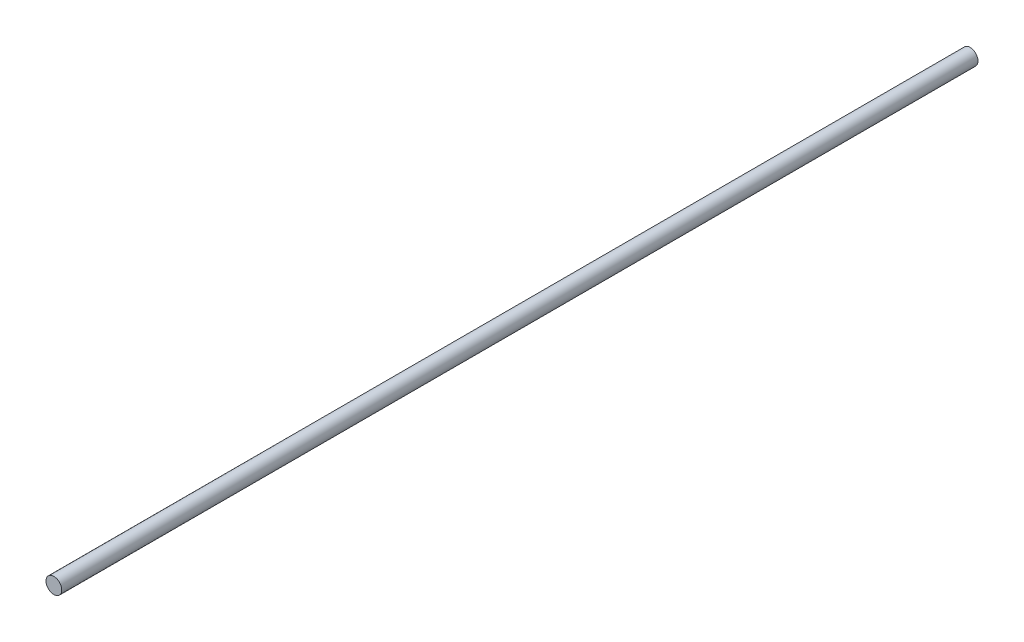
ISO-10303-21;
HEADER;
FILE_DESCRIPTION(('STEP AP214'),'2;1');
FILE_NAME('part.step','',(''),(''),'','','');
FILE_SCHEMA(('AUTOMOTIVE_DESIGN { 1 0 10303 214 1 1 1 1 }'));
ENDSEC;
DATA;
#1=APPLICATION_CONTEXT('core data for automotive mechanical design processes');
#2=APPLICATION_PROTOCOL_DEFINITION('international standard','automotive_design',2000,#1);
#3=PRODUCT_CONTEXT('',#1,'mechanical');
#4=PRODUCT('Part','Part','',(#3));
#5=PRODUCT_RELATED_PRODUCT_CATEGORY('part','',(#4));
#6=PRODUCT_DEFINITION_FORMATION('','',#4);
#7=PRODUCT_DEFINITION_CONTEXT('part definition',#1,'design');
#8=PRODUCT_DEFINITION('design','',#6,#7);
#9=PRODUCT_DEFINITION_SHAPE('','',#8);
#10=(LENGTH_UNIT() NAMED_UNIT(*) SI_UNIT(.MILLI.,.METRE.));
#11=(NAMED_UNIT(*) PLANE_ANGLE_UNIT() SI_UNIT($,.RADIAN.));
#12=(NAMED_UNIT(*) SI_UNIT($,.STERADIAN.) SOLID_ANGLE_UNIT());
#13=UNCERTAINTY_MEASURE_WITH_UNIT(LENGTH_MEASURE(1.E-05),#10,'distance_accuracy_value','');
#14=(GEOMETRIC_REPRESENTATION_CONTEXT(3) GLOBAL_UNCERTAINTY_ASSIGNED_CONTEXT((#13)) GLOBAL_UNIT_ASSIGNED_CONTEXT((#10,
#11,#12)) REPRESENTATION_CONTEXT('',''));
#15=CARTESIAN_POINT('',(0.,0.,0.));
#16=DIRECTION('',(0.,0.,1.));
#17=DIRECTION('',(1.,0.,0.));
#18=AXIS2_PLACEMENT_3D('',#15,#16,#17);
#19=CARTESIAN_POINT('',(0.,0.,465.));
#20=DIRECTION('',(0.,0.,-1.));
#21=DIRECTION('',(-1.,0.,0.));
#22=AXIS2_PLACEMENT_3D('',#19,#20,#21);
#23=CYLINDRICAL_SURFACE('',#22,4.);
#24=CARTESIAN_POINT('',(0.,0.,465.));
#25=DIRECTION('',(0.,0.,1.));
#26=DIRECTION('',(1.,0.,0.));
#27=AXIS2_PLACEMENT_3D('',#24,#25,#26);
#28=CIRCLE('',#27,4.);
#29=CARTESIAN_POINT('',(4.,0.,465.));
#30=VERTEX_POINT('',#29);
#31=EDGE_CURVE('E10',#30,#30,#28,.T.);
#32=ORIENTED_EDGE('',*,*,#31,.F.);
#33=EDGE_LOOP('',(#32));
#34=FACE_BOUND('',#33,.T.);
#35=CARTESIAN_POINT('',(0.,0.,0.));
#36=DIRECTION('',(0.,0.,1.));
#37=DIRECTION('',(1.,0.,0.));
#38=AXIS2_PLACEMENT_3D('',#35,#36,#37);
#39=CIRCLE('',#38,4.);
#40=CARTESIAN_POINT('',(4.,0.,0.));
#41=VERTEX_POINT('',#40);
#42=EDGE_CURVE('E38',#41,#41,#39,.T.);
#43=ORIENTED_EDGE('',*,*,#42,.T.);
#44=EDGE_LOOP('',(#43));
#45=FACE_BOUND('',#44,.T.);
#46=ADVANCED_FACE('F35',(#34,#45),#23,.T.);
#47=CARTESIAN_POINT('',(0.,0.,465.));
#48=DIRECTION('',(0.,0.,1.));
#49=DIRECTION('',(1.,0.,0.));
#50=AXIS2_PLACEMENT_3D('',#47,#48,#49);
#51=PLANE('',#50);
#52=ORIENTED_EDGE('',*,*,#31,.T.);
#53=EDGE_LOOP('',(#52));
#54=FACE_BOUND('',#53,.T.);
#55=ADVANCED_FACE('F50',(#54),#51,.T.);
#56=CARTESIAN_POINT('',(0.,0.,0.));
#57=DIRECTION('',(0.,0.,1.));
#58=DIRECTION('',(1.,0.,0.));
#59=AXIS2_PLACEMENT_3D('',#56,#57,#58);
#60=PLANE('',#59);
#61=ORIENTED_EDGE('',*,*,#42,.F.);
#62=EDGE_LOOP('',(#61));
#63=FACE_BOUND('',#62,.T.);
#64=ADVANCED_FACE('F48',(#63),#60,.F.);
#65=CLOSED_SHELL('',(#46,#55,#64));
#66=MANIFOLD_SOLID_BREP('B2',#65);
#67=ADVANCED_BREP_SHAPE_REPRESENTATION('',(#18,#66),#14);
#68=SHAPE_DEFINITION_REPRESENTATION(#9,#67);
ENDSEC;
END-ISO-10303-21;
